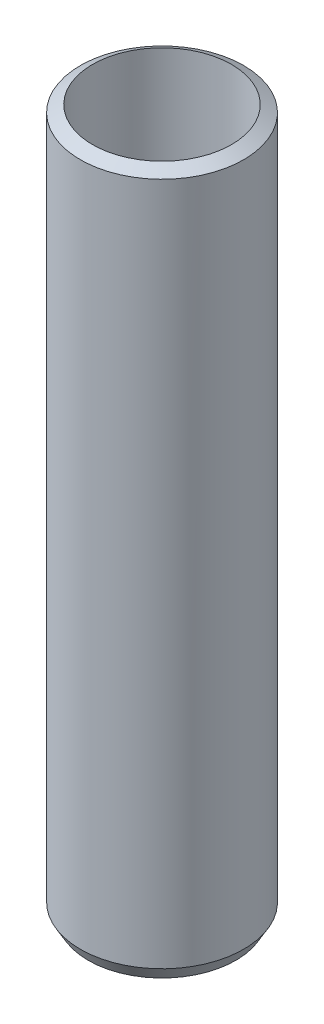
ISO-10303-21;
HEADER;
FILE_DESCRIPTION(('STEP AP214'),'2;1');
FILE_NAME('part.step','',(''),(''),'','','');
FILE_SCHEMA(('AUTOMOTIVE_DESIGN { 1 0 10303 214 1 1 1 1 }'));
ENDSEC;
DATA;
#1=APPLICATION_CONTEXT('core data for automotive mechanical design processes');
#2=APPLICATION_PROTOCOL_DEFINITION('international standard','automotive_design',2000,#1);
#3=PRODUCT_CONTEXT('',#1,'mechanical');
#4=PRODUCT('Part','Part','',(#3));
#5=PRODUCT_RELATED_PRODUCT_CATEGORY('part','',(#4));
#6=PRODUCT_DEFINITION_FORMATION('','',#4);
#7=PRODUCT_DEFINITION_CONTEXT('part definition',#1,'design');
#8=PRODUCT_DEFINITION('design','',#6,#7);
#9=PRODUCT_DEFINITION_SHAPE('','',#8);
#10=(LENGTH_UNIT() NAMED_UNIT(*) SI_UNIT(.MILLI.,.METRE.));
#11=(NAMED_UNIT(*) PLANE_ANGLE_UNIT() SI_UNIT($,.RADIAN.));
#12=(NAMED_UNIT(*) SI_UNIT($,.STERADIAN.) SOLID_ANGLE_UNIT());
#13=UNCERTAINTY_MEASURE_WITH_UNIT(LENGTH_MEASURE(1.E-05),#10,'distance_accuracy_value','');
#14=(GEOMETRIC_REPRESENTATION_CONTEXT(3) GLOBAL_UNCERTAINTY_ASSIGNED_CONTEXT((#13)) GLOBAL_UNIT_ASSIGNED_CONTEXT((#10,
#11,#12)) REPRESENTATION_CONTEXT('',''));
#15=CARTESIAN_POINT('',(0.,0.,0.));
#16=DIRECTION('',(0.,0.,1.));
#17=DIRECTION('',(1.,0.,0.));
#18=AXIS2_PLACEMENT_3D('',#15,#16,#17);
#19=CARTESIAN_POINT('',(0.,518.070102063026,0.));
#20=DIRECTION('',(0.,-1.,0.));
#21=DIRECTION('',(0.,0.,-1.));
#22=AXIS2_PLACEMENT_3D('',#19,#20,#21);
#23=CYLINDRICAL_SURFACE('',#22,60.);
#24=CARTESIAN_POINT('',(0.,512.326445117173,0.));
#25=DIRECTION('',(0.,1.,0.));
#26=DIRECTION('',(0.,0.,1.));
#27=AXIS2_PLACEMENT_3D('',#24,#25,#26);
#28=CIRCLE('',#27,60.);
#29=CARTESIAN_POINT('',(0.,512.326445117172,-60.0000000000001));
#30=VERTEX_POINT('',#29);
#31=EDGE_CURVE('E50',#30,#30,#28,.F.);
#32=ORIENTED_EDGE('',*,*,#31,.T.);
#33=EDGE_LOOP('',(#32));
#34=FACE_BOUND('',#33,.T.);
#35=CARTESIAN_POINT('',(0.,9.94830565146321,0.));
#36=DIRECTION('',(0.,1.,0.));
#37=DIRECTION('',(0.,0.,1.));
#38=AXIS2_PLACEMENT_3D('',#35,#36,#37);
#39=CIRCLE('',#38,60.);
#40=CARTESIAN_POINT('',(0.,9.94830565146321,60.));
#41=VERTEX_POINT('',#40);
#42=EDGE_CURVE('E51',#41,#41,#39,.T.);
#43=ORIENTED_EDGE('',*,*,#42,.T.);
#44=EDGE_LOOP('',(#43));
#45=FACE_BOUND('',#44,.T.);
#46=ADVANCED_FACE('F39',(#34,#45),#23,.T.);
#47=CARTESIAN_POINT('',(0.,0.,0.));
#48=DIRECTION('',(0.,1.,0.));
#49=DIRECTION('',(0.,0.,1.));
#50=AXIS2_PLACEMENT_3D('',#47,#48,#49);
#51=PLANE('',#50);
#52=CARTESIAN_POINT('',(0.,0.,0.));
#53=DIRECTION('',(0.,1.,0.));
#54=DIRECTION('',(0.,0.,1.));
#55=AXIS2_PLACEMENT_3D('',#52,#53,#54);
#56=CIRCLE('',#55,54.256343054147);
#57=CARTESIAN_POINT('',(0.,0.,54.256343054147));
#58=VERTEX_POINT('',#57);
#59=EDGE_CURVE('E10',#58,#58,#56,.F.);
#60=ORIENTED_EDGE('',*,*,#59,.T.);
#61=EDGE_LOOP('',(#60));
#62=FACE_BOUND('',#61,.T.);
#63=CARTESIAN_POINT('',(0.,0.,0.));
#64=DIRECTION('',(0.,1.,0.));
#65=DIRECTION('',(0.,0.,1.));
#66=AXIS2_PLACEMENT_3D('',#63,#64,#65);
#67=CIRCLE('',#66,51.068545556716);
#68=CARTESIAN_POINT('',(0.,0.,51.068545556716));
#69=VERTEX_POINT('',#68);
#70=EDGE_CURVE('E58',#69,#69,#67,.T.);
#71=ORIENTED_EDGE('',*,*,#70,.T.);
#72=EDGE_LOOP('',(#71));
#73=FACE_BOUND('',#72,.T.);
#74=ADVANCED_FACE('F62',(#62,#73),#51,.F.);
#75=CARTESIAN_POINT('',(0.,518.070102063026,0.));
#76=DIRECTION('',(0.,-1.,0.));
#77=DIRECTION('',(0.,0.,-1.));
#78=AXIS2_PLACEMENT_3D('',#75,#76,#77);
#79=CYLINDRICAL_SURFACE('',#78,51.068545556716);
#80=CARTESIAN_POINT('',(0.,517.483022744257,0.));
#81=DIRECTION('',(0.,-1.,0.));
#82=DIRECTION('',(0.,0.,-1.));
#83=AXIS2_PLACEMENT_3D('',#80,#81,#82);
#84=CIRCLE('',#83,51.068545556716);
#85=CARTESIAN_POINT('',(0.,517.483022744257,-51.0685455567159));
#86=VERTEX_POINT('',#85);
#87=EDGE_CURVE('E54',#86,#86,#84,.F.);
#88=ORIENTED_EDGE('',*,*,#87,.T.);
#89=EDGE_LOOP('',(#88));
#90=FACE_BOUND('',#89,.T.);
#91=ORIENTED_EDGE('',*,*,#70,.F.);
#92=EDGE_LOOP('',(#91));
#93=FACE_BOUND('',#92,.T.);
#94=ADVANCED_FACE('F68',(#90,#93),#79,.F.);
#95=CARTESIAN_POINT('',(0.,518.070102063026,0.));
#96=DIRECTION('',(0.,-1.,0.));
#97=DIRECTION('',(0.,0.,-1.));
#98=AXIS2_PLACEMENT_3D('',#95,#96,#97);
#99=CONICAL_SURFACE('',#98,50.0516943485365,1.0471975511966);
#100=CARTESIAN_POINT('',(0.,512.326445117172,-60.0000000000001));
#101=CARTESIAN_POINT('',(0.,512.380159467455,-59.9069640162159));
#102=CARTESIAN_POINT('',(0.,512.433873817737,-59.8139280324317));
#103=CARTESIAN_POINT('',(0.,512.541302518301,-59.6278560648633));
#104=CARTESIAN_POINT('',(0.,512.595016868583,-59.534820081079));
#105=CARTESIAN_POINT('',(0.,512.702445569147,-59.3487481135106));
#106=CARTESIAN_POINT('',(0.,512.75615991943,-59.2557121297264));
#107=CARTESIAN_POINT('',(0.,512.863588619994,-59.069640162158));
#108=CARTESIAN_POINT('',(0.,512.917302970276,-58.9766041783738));
#109=CARTESIAN_POINT('',(0.,513.02473167084,-58.7905322108054));
#110=CARTESIAN_POINT('',(0.,513.078446021122,-58.6974962270212));
#111=CARTESIAN_POINT('',(0.,513.185874721687,-58.5114242594527));
#112=CARTESIAN_POINT('',(0.,513.239589071969,-58.4183882756685));
#113=CARTESIAN_POINT('',(0.,513.347017772533,-58.2323163081001));
#114=CARTESIAN_POINT('',(0.,513.400732122815,-58.1392803243159));
#115=CARTESIAN_POINT('',(0.,513.50816082338,-57.9532083567475));
#116=CARTESIAN_POINT('',(0.,513.561875173662,-57.8601723729633));
#117=CARTESIAN_POINT('',(0.,513.669303874226,-57.6741004053948));
#118=CARTESIAN_POINT('',(0.,513.723018224508,-57.5810644216106));
#119=CARTESIAN_POINT('',(0.,513.830446925072,-57.3949924540422));
#120=CARTESIAN_POINT('',(0.,513.884161275354,-57.301956470258));
#121=CARTESIAN_POINT('',(0.,513.991589975919,-57.1158845026896));
#122=CARTESIAN_POINT('',(0.,514.045304326201,-57.0228485189054));
#123=CARTESIAN_POINT('',(0.,514.152733026765,-56.8367765513369));
#124=CARTESIAN_POINT('',(0.,514.206447377047,-56.7437405675527));
#125=CARTESIAN_POINT('',(0.,514.313876077611,-56.5576685999843));
#126=CARTESIAN_POINT('',(0.,514.367590427894,-56.4646326162001));
#127=CARTESIAN_POINT('',(0.,514.475019128458,-56.2785606486317));
#128=CARTESIAN_POINT('',(0.,514.52873347874,-56.1855246648475));
#129=CARTESIAN_POINT('',(0.,514.636162179304,-55.9994526972791));
#130=CARTESIAN_POINT('',(0.,514.689876529586,-55.9064167134948));
#131=CARTESIAN_POINT('',(0.,514.797305230151,-55.7203447459264));
#132=CARTESIAN_POINT('',(0.,514.851019580433,-55.6273087621422));
#133=CARTESIAN_POINT('',(0.,514.958448280997,-55.4412367945738));
#134=CARTESIAN_POINT('',(0.,515.012162631279,-55.3482008107896));
#135=CARTESIAN_POINT('',(0.,515.119591331843,-55.1621288432212));
#136=CARTESIAN_POINT('',(0.,515.173305682126,-55.0690928594369));
#137=CARTESIAN_POINT('',(0.,515.28073438269,-54.8830208918685));
#138=CARTESIAN_POINT('',(0.,515.334448732972,-54.7899849080843));
#139=CARTESIAN_POINT('',(0.,515.441877433536,-54.6039129405159));
#140=CARTESIAN_POINT('',(0.,515.495591783818,-54.5108769567317));
#141=CARTESIAN_POINT('',(0.,515.603020484383,-54.3248049891633));
#142=CARTESIAN_POINT('',(0.,515.656734834665,-54.2317690053791));
#143=CARTESIAN_POINT('',(0.,515.764163535229,-54.0456970378106));
#144=CARTESIAN_POINT('',(0.,515.817877885511,-53.9526610540264));
#145=CARTESIAN_POINT('',(0.,515.925306586076,-53.766589086458));
#146=CARTESIAN_POINT('',(0.,515.979020936358,-53.6735531026738));
#147=CARTESIAN_POINT('',(0.,516.086449636922,-53.4874811351054));
#148=CARTESIAN_POINT('',(0.,516.140163987204,-53.3944451513212));
#149=CARTESIAN_POINT('',(0.,516.247592687768,-53.2083731837527));
#150=CARTESIAN_POINT('',(0.,516.30130703805,-53.1153371999685));
#151=CARTESIAN_POINT('',(0.,516.408735738615,-52.9292652324001));
#152=CARTESIAN_POINT('',(0.,516.462450088897,-52.8362292486159));
#153=CARTESIAN_POINT('',(0.,516.569878789461,-52.6501572810475));
#154=CARTESIAN_POINT('',(0.,516.623593139743,-52.5571212972633));
#155=CARTESIAN_POINT('',(0.,516.731021840307,-52.3710493296948));
#156=CARTESIAN_POINT('',(0.,516.78473619059,-52.2780133459106));
#157=CARTESIAN_POINT('',(0.,516.892164891154,-52.0919413783422));
#158=CARTESIAN_POINT('',(0.,516.945879241436,-51.998905394558));
#159=CARTESIAN_POINT('',(0.,517.053307942,-51.8128334269896));
#160=CARTESIAN_POINT('',(0.,517.107022292283,-51.7197974432054));
#161=CARTESIAN_POINT('',(0.,517.214450992847,-51.533725475637));
#162=CARTESIAN_POINT('',(0.,517.268165343129,-51.4406894918527));
#163=CARTESIAN_POINT('',(0.,517.375594043693,-51.2546175242843));
#164=CARTESIAN_POINT('',(0.,517.429308393975,-51.1615815405001));
#165=CARTESIAN_POINT('',(0.,517.483022744257,-51.0685455567159));
#166=B_SPLINE_CURVE_WITH_KNOTS('',3,(#100,#101,#102,#103,#104,#105,#106,#107,#108,#109,#110,
#111,#112,#113,#114,#115,#116,#117,#118,#119,#120,#121,#122,#123,#124,#125,#126,#127,#128,#129,
#130,#131,#132,#133,#134,#135,#136,#137,#138,#139,#140,#141,#142,#143,#144,#145,#146,#147,#148,
#149,#150,#151,#152,#153,#154,#155,#156,#157,#158,#159,#160,#161,#162,#163,#164,#165),
.UNSPECIFIED.,.F.,.F.,(4,2,2,2,2,2,2,2,2,2,2,2,2,2,2,2,2,2,2,2,2,2,2,2,2,2,2,2,2,2,2,2,4),(0.,
0.322286101692842,0.644572203385629,0.966858305078478,1.28914440677126,1.61143050846411,
1.93371661015689,2.25600271184974,2.57828881354253,2.90057491523532,3.22286101692816,
3.54514711862095,3.86743322031379,4.18971932200658,4.51200542369943,4.83429152539222,
5.156577627085,5.47886372877785,5.80114983047064,6.12343593216348,6.44572203385627,
6.76800813554912,7.0902942372419,7.41258033893474,7.73486644062754,8.05715254232032,
8.37943864401317,8.70172474570595,9.0240108473988,9.34629694909159,9.66858305078443,
9.99086915247723,10.3131552541701),.UNSPECIFIED.);
#167=EDGE_CURVE('BSEAM66',#30,#86,#166,.T.);
#168=ORIENTED_EDGE('',*,*,#31,.F.);
#169=ORIENTED_EDGE('',*,*,#87,.F.);
#170=ORIENTED_EDGE('',*,*,#167,.T.);
#171=ORIENTED_EDGE('',*,*,#167,.F.);
#172=EDGE_LOOP('',(#168,#170,#169,#171));
#173=FACE_BOUND('',#172,.T.);
#174=ADVANCED_FACE('F66',(#173),#99,.T.);
#175=CARTESIAN_POINT('',(0.,9.94830565146321,0.));
#176=DIRECTION('',(0.,1.,0.));
#177=DIRECTION('',(0.,0.,1.));
#178=AXIS2_PLACEMENT_3D('',#175,#176,#177);
#179=CONICAL_SURFACE('',#178,60.,0.523598775598299);
#180=ORIENTED_EDGE('',*,*,#59,.F.);
#181=EDGE_LOOP('',(#180));
#182=FACE_BOUND('',#181,.T.);
#183=ORIENTED_EDGE('',*,*,#42,.F.);
#184=EDGE_LOOP('',(#183));
#185=FACE_BOUND('',#184,.T.);
#186=ADVANCED_FACE('F45',(#182,#185),#179,.T.);
#187=CLOSED_SHELL('',(#46,#74,#94,#174,#186));
#188=MANIFOLD_SOLID_BREP('B2',#187);
#189=ADVANCED_BREP_SHAPE_REPRESENTATION('',(#18,#188),#14);
#190=SHAPE_DEFINITION_REPRESENTATION(#9,#189);
ENDSEC;
END-ISO-10303-21;
